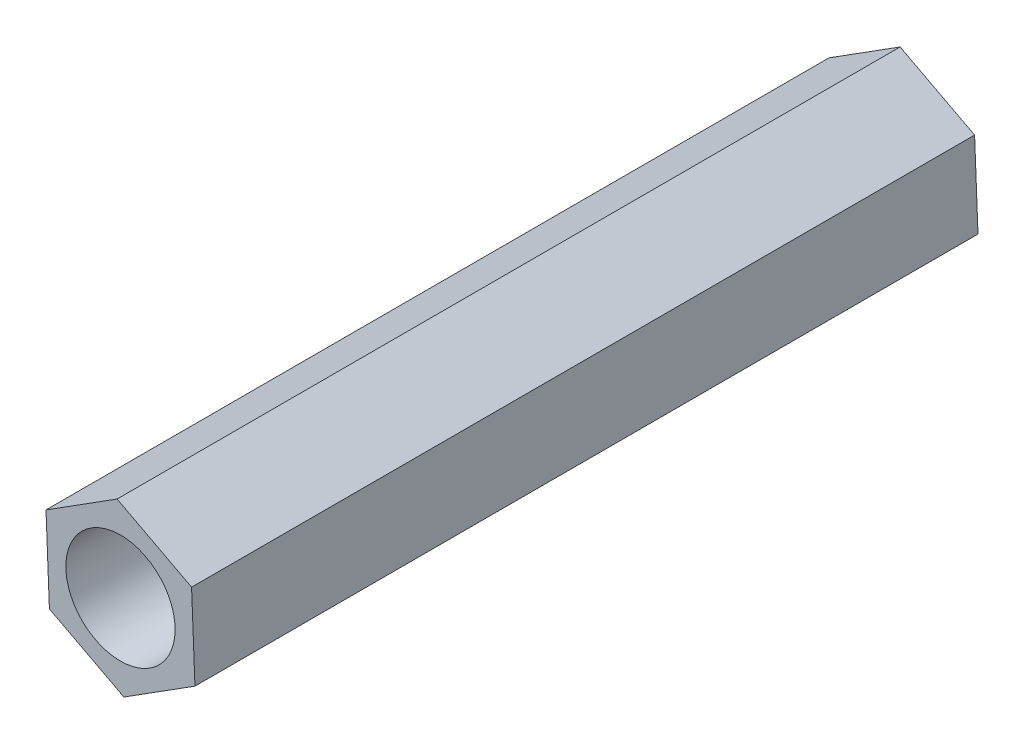
ISO-10303-21;
HEADER;
FILE_DESCRIPTION(('STEP AP214'),'2;1');
FILE_NAME('part.step','',(''),(''),'','','');
FILE_SCHEMA(('AUTOMOTIVE_DESIGN { 1 0 10303 214 1 1 1 1 }'));
ENDSEC;
DATA;
#1=APPLICATION_CONTEXT('core data for automotive mechanical design processes');
#2=APPLICATION_PROTOCOL_DEFINITION('international standard','automotive_design',2000,#1);
#3=PRODUCT_CONTEXT('',#1,'mechanical');
#4=PRODUCT('Part','Part','',(#3));
#5=PRODUCT_RELATED_PRODUCT_CATEGORY('part','',(#4));
#6=PRODUCT_DEFINITION_FORMATION('','',#4);
#7=PRODUCT_DEFINITION_CONTEXT('part definition',#1,'design');
#8=PRODUCT_DEFINITION('design','',#6,#7);
#9=PRODUCT_DEFINITION_SHAPE('','',#8);
#10=(LENGTH_UNIT() NAMED_UNIT(*) SI_UNIT(.MILLI.,.METRE.));
#11=(NAMED_UNIT(*) PLANE_ANGLE_UNIT() SI_UNIT($,.RADIAN.));
#12=(NAMED_UNIT(*) SI_UNIT($,.STERADIAN.) SOLID_ANGLE_UNIT());
#13=UNCERTAINTY_MEASURE_WITH_UNIT(LENGTH_MEASURE(1.E-05),#10,'distance_accuracy_value','');
#14=(GEOMETRIC_REPRESENTATION_CONTEXT(3) GLOBAL_UNCERTAINTY_ASSIGNED_CONTEXT((#13)) GLOBAL_UNIT_ASSIGNED_CONTEXT((#10,
#11,#12)) REPRESENTATION_CONTEXT('',''));
#15=CARTESIAN_POINT('',(0.,0.,0.));
#16=DIRECTION('',(0.,0.,1.));
#17=DIRECTION('',(1.,0.,0.));
#18=AXIS2_PLACEMENT_3D('',#15,#16,#17);
#19=CARTESIAN_POINT('',(0.187134398577114,-4.61500964789918,43.));
#20=DIRECTION('',(-0.53467714895708,0.845056416094883,0.));
#21=DIRECTION('',(-0.845056416094883,-0.53467714895708,0.));
#22=AXIS2_PLACEMENT_3D('',#19,#20,#21);
#23=PLANE('',#22);
#24=DIRECTION('',(0.845056416094883,0.53467714895708,0.));
#25=VECTOR('',#24,1.);
#26=CARTESIAN_POINT('',(0.187134398577114,-4.61500964789918,0.));
#27=LINE('',#26,#25);
#28=CARTESIAN_POINT('',(0.187134398577114,-4.61500964789918,0.));
#29=VERTEX_POINT('',#28);
#30=CARTESIAN_POINT('',(4.09028279307953,-2.14544168085989,0.));
#31=VERTEX_POINT('',#30);
#32=EDGE_CURVE('E131',#29,#31,#27,.T.);
#33=ORIENTED_EDGE('',*,*,#32,.T.);
#34=DIRECTION('',(0.,0.,-1.));
#35=VECTOR('',#34,1.);
#36=CARTESIAN_POINT('',(4.09028279307953,-2.14544168085989,43.));
#37=LINE('',#36,#35);
#38=CARTESIAN_POINT('',(4.09028279307953,-2.14544168085989,43.));
#39=VERTEX_POINT('',#38);
#40=EDGE_CURVE('E11',#39,#31,#37,.T.);
#41=ORIENTED_EDGE('',*,*,#40,.F.);
#42=DIRECTION('',(0.845056416094883,0.53467714895708,0.));
#43=VECTOR('',#42,1.);
#44=CARTESIAN_POINT('',(0.187134398577114,-4.61500964789918,43.));
#45=LINE('',#44,#43);
#46=CARTESIAN_POINT('',(0.187134398577114,-4.61500964789918,43.));
#47=VERTEX_POINT('',#46);
#48=EDGE_CURVE('E141',#47,#39,#45,.T.);
#49=ORIENTED_EDGE('',*,*,#48,.F.);
#50=DIRECTION('',(0.,0.,-1.));
#51=VECTOR('',#50,1.);
#52=CARTESIAN_POINT('',(0.187134398577114,-4.61500964789918,43.));
#53=LINE('',#52,#51);
#54=EDGE_CURVE('E118',#47,#29,#53,.T.);
#55=ORIENTED_EDGE('',*,*,#54,.T.);
#56=EDGE_LOOP('',(#33,#41,#49,#55));
#57=FACE_BOUND('',#56,.T.);
#58=ADVANCED_FACE('F37',(#57),#23,.F.);
#59=CARTESIAN_POINT('',(4.09028279307953,-2.14544168085989,43.));
#60=DIRECTION('',(-0.999178898447742,-0.0405157857724263,0.));
#61=DIRECTION('',(0.0405157857724263,-0.999178898447742,0.));
#62=AXIS2_PLACEMENT_3D('',#59,#60,#61);
#63=PLANE('',#62);
#64=DIRECTION('',(-0.0405157857724263,0.999178898447742,0.));
#65=VECTOR('',#64,1.);
#66=CARTESIAN_POINT('',(4.09028279307953,-2.14544168085989,0.));
#67=LINE('',#66,#65);
#68=CARTESIAN_POINT('',(3.90314839450241,2.4695679670393,0.));
#69=VERTEX_POINT('',#68);
#70=EDGE_CURVE('E127',#31,#69,#67,.T.);
#71=ORIENTED_EDGE('',*,*,#70,.T.);
#72=DIRECTION('',(0.,0.,-1.));
#73=VECTOR('',#72,1.);
#74=CARTESIAN_POINT('',(3.90314839450241,2.4695679670393,43.));
#75=LINE('',#74,#73);
#76=CARTESIAN_POINT('',(3.90314839450241,2.4695679670393,43.));
#77=VERTEX_POINT('',#76);
#78=EDGE_CURVE('E45',#77,#69,#75,.T.);
#79=ORIENTED_EDGE('',*,*,#78,.F.);
#80=DIRECTION('',(-0.0405157857724263,0.999178898447742,0.));
#81=VECTOR('',#80,1.);
#82=CARTESIAN_POINT('',(4.09028279307953,-2.14544168085989,43.));
#83=LINE('',#82,#81);
#84=EDGE_CURVE('E86',#39,#77,#83,.T.);
#85=ORIENTED_EDGE('',*,*,#84,.F.);
#86=ORIENTED_EDGE('',*,*,#40,.T.);
#87=EDGE_LOOP('',(#71,#79,#85,#86));
#88=FACE_BOUND('',#87,.T.);
#89=ADVANCED_FACE('F128',(#88),#63,.F.);
#90=CARTESIAN_POINT('',(3.90314839450241,2.4695679670393,43.));
#91=DIRECTION('',(-0.464501749490663,-0.885572201867309,0.));
#92=DIRECTION('',(0.885572201867309,-0.464501749490663,0.));
#93=AXIS2_PLACEMENT_3D('',#90,#91,#92);
#94=PLANE('',#93);
#95=DIRECTION('',(-0.885572201867309,0.464501749490663,0.));
#96=VECTOR('',#95,1.);
#97=CARTESIAN_POINT('',(3.90314839450241,2.4695679670393,0.));
#98=LINE('',#97,#96);
#99=CARTESIAN_POINT('',(-0.187134398577112,4.61500964789918,0.));
#100=VERTEX_POINT('',#99);
#101=EDGE_CURVE('E126',#69,#100,#98,.T.);
#102=ORIENTED_EDGE('',*,*,#101,.T.);
#103=DIRECTION('',(0.,0.,-1.));
#104=VECTOR('',#103,1.);
#105=CARTESIAN_POINT('',(-0.187134398577112,4.61500964789918,43.));
#106=LINE('',#105,#104);
#107=CARTESIAN_POINT('',(-0.187134398577112,4.61500964789918,43.));
#108=VERTEX_POINT('',#107);
#109=EDGE_CURVE('E115',#108,#100,#106,.T.);
#110=ORIENTED_EDGE('',*,*,#109,.F.);
#111=DIRECTION('',(-0.885572201867309,0.464501749490663,0.));
#112=VECTOR('',#111,1.);
#113=CARTESIAN_POINT('',(3.90314839450241,2.4695679670393,43.));
#114=LINE('',#113,#112);
#115=EDGE_CURVE('E108',#77,#108,#114,.T.);
#116=ORIENTED_EDGE('',*,*,#115,.F.);
#117=ORIENTED_EDGE('',*,*,#78,.T.);
#118=EDGE_LOOP('',(#102,#110,#116,#117));
#119=FACE_BOUND('',#118,.T.);
#120=ADVANCED_FACE('F125',(#119),#94,.F.);
#121=CARTESIAN_POINT('',(-0.187134398577112,4.61500964789918,43.));
#122=DIRECTION('',(0.53467714895708,-0.845056416094883,0.));
#123=DIRECTION('',(0.845056416094883,0.53467714895708,0.));
#124=AXIS2_PLACEMENT_3D('',#121,#122,#123);
#125=PLANE('',#124);
#126=DIRECTION('',(-0.845056416094883,-0.53467714895708,0.));
#127=VECTOR('',#126,1.);
#128=CARTESIAN_POINT('',(-0.187134398577112,4.61500964789918,0.));
#129=LINE('',#128,#127);
#130=CARTESIAN_POINT('',(-4.09028279307953,2.14544168085989,0.));
#131=VERTEX_POINT('',#130);
#132=EDGE_CURVE('E114',#100,#131,#129,.T.);
#133=ORIENTED_EDGE('',*,*,#132,.T.);
#134=DIRECTION('',(0.,0.,-1.));
#135=VECTOR('',#134,1.);
#136=CARTESIAN_POINT('',(-4.09028279307953,2.14544168085989,43.));
#137=LINE('',#136,#135);
#138=CARTESIAN_POINT('',(-4.09028279307953,2.14544168085989,43.));
#139=VERTEX_POINT('',#138);
#140=EDGE_CURVE('E101',#139,#131,#137,.T.);
#141=ORIENTED_EDGE('',*,*,#140,.F.);
#142=DIRECTION('',(-0.845056416094883,-0.53467714895708,0.));
#143=VECTOR('',#142,1.);
#144=CARTESIAN_POINT('',(-0.187134398577112,4.61500964789918,43.));
#145=LINE('',#144,#143);
#146=EDGE_CURVE('E104',#108,#139,#145,.T.);
#147=ORIENTED_EDGE('',*,*,#146,.F.);
#148=ORIENTED_EDGE('',*,*,#109,.T.);
#149=EDGE_LOOP('',(#133,#141,#147,#148));
#150=FACE_BOUND('',#149,.T.);
#151=ADVANCED_FACE('F113',(#150),#125,.F.);
#152=CARTESIAN_POINT('',(-4.09028279307953,2.14544168085989,43.));
#153=DIRECTION('',(0.999178898447742,0.0405157857724258,0.));
#154=DIRECTION('',(-0.0405157857724258,0.999178898447742,0.));
#155=AXIS2_PLACEMENT_3D('',#152,#153,#154);
#156=PLANE('',#155);
#157=DIRECTION('',(0.0405157857724258,-0.999178898447742,0.));
#158=VECTOR('',#157,1.);
#159=CARTESIAN_POINT('',(-4.09028279307953,2.14544168085989,0.));
#160=LINE('',#159,#158);
#161=CARTESIAN_POINT('',(-3.90314839450241,-2.46956796703929,0.));
#162=VERTEX_POINT('',#161);
#163=EDGE_CURVE('E139',#131,#162,#160,.T.);
#164=ORIENTED_EDGE('',*,*,#163,.T.);
#165=DIRECTION('',(0.,0.,-1.));
#166=VECTOR('',#165,1.);
#167=CARTESIAN_POINT('',(-3.90314839450241,-2.46956796703929,43.));
#168=LINE('',#167,#166);
#169=CARTESIAN_POINT('',(-3.90314839450241,-2.46956796703929,43.));
#170=VERTEX_POINT('',#169);
#171=EDGE_CURVE('E103',#170,#162,#168,.T.);
#172=ORIENTED_EDGE('',*,*,#171,.F.);
#173=DIRECTION('',(0.0405157857724258,-0.999178898447742,0.));
#174=VECTOR('',#173,1.);
#175=CARTESIAN_POINT('',(-4.09028279307953,2.14544168085989,43.));
#176=LINE('',#175,#174);
#177=EDGE_CURVE('E96',#139,#170,#176,.T.);
#178=ORIENTED_EDGE('',*,*,#177,.F.);
#179=ORIENTED_EDGE('',*,*,#140,.T.);
#180=EDGE_LOOP('',(#164,#172,#178,#179));
#181=FACE_BOUND('',#180,.T.);
#182=ADVANCED_FACE('F99',(#181),#156,.F.);
#183=CARTESIAN_POINT('',(-3.90314839450241,-2.46956796703929,43.));
#184=DIRECTION('',(0.464501749490662,0.885572201867309,0.));
#185=DIRECTION('',(-0.885572201867309,0.464501749490662,0.));
#186=AXIS2_PLACEMENT_3D('',#183,#184,#185);
#187=PLANE('',#186);
#188=DIRECTION('',(0.885572201867309,-0.464501749490662,0.));
#189=VECTOR('',#188,1.);
#190=CARTESIAN_POINT('',(-3.90314839450241,-2.46956796703929,0.));
#191=LINE('',#190,#189);
#192=EDGE_CURVE('E75',#162,#29,#191,.T.);
#193=ORIENTED_EDGE('',*,*,#192,.T.);
#194=ORIENTED_EDGE('',*,*,#54,.F.);
#195=DIRECTION('',(0.885572201867309,-0.464501749490662,0.));
#196=VECTOR('',#195,1.);
#197=CARTESIAN_POINT('',(-3.90314839450241,-2.46956796703929,43.));
#198=LINE('',#197,#196);
#199=EDGE_CURVE('E53',#170,#47,#198,.T.);
#200=ORIENTED_EDGE('',*,*,#199,.F.);
#201=ORIENTED_EDGE('',*,*,#171,.T.);
#202=EDGE_LOOP('',(#193,#194,#200,#201));
#203=FACE_BOUND('',#202,.T.);
#204=ADVANCED_FACE('F159',(#203),#187,.F.);
#205=CARTESIAN_POINT('',(0.,0.,43.));
#206=DIRECTION('',(0.,0.,1.));
#207=DIRECTION('',(1.,0.,0.));
#208=AXIS2_PLACEMENT_3D('',#205,#206,#207);
#209=PLANE('',#208);
#210=CARTESIAN_POINT('',(0.,0.,43.));
#211=DIRECTION('',(0.,0.,1.));
#212=DIRECTION('',(1.,0.,0.));
#213=AXIS2_PLACEMENT_3D('',#210,#211,#212);
#214=CIRCLE('',#213,3.);
#215=CARTESIAN_POINT('',(3.,0.,43.));
#216=VERTEX_POINT('',#215);
#217=EDGE_CURVE('E150',#216,#216,#214,.T.);
#218=ORIENTED_EDGE('',*,*,#217,.F.);
#219=EDGE_LOOP('',(#218));
#220=FACE_BOUND('',#219,.T.);
#221=ORIENTED_EDGE('',*,*,#48,.T.);
#222=ORIENTED_EDGE('',*,*,#84,.T.);
#223=ORIENTED_EDGE('',*,*,#115,.T.);
#224=ORIENTED_EDGE('',*,*,#146,.T.);
#225=ORIENTED_EDGE('',*,*,#177,.T.);
#226=ORIENTED_EDGE('',*,*,#199,.T.);
#227=EDGE_LOOP('',(#221,#222,#223,#224,#225,#226));
#228=FACE_BOUND('',#227,.T.);
#229=ADVANCED_FACE('F107',(#220,#228),#209,.T.);
#230=CARTESIAN_POINT('',(0.,0.,0.));
#231=DIRECTION('',(0.,0.,1.));
#232=DIRECTION('',(1.,0.,0.));
#233=AXIS2_PLACEMENT_3D('',#230,#231,#232);
#234=PLANE('',#233);
#235=CARTESIAN_POINT('',(0.,0.,0.));
#236=DIRECTION('',(0.,0.,1.));
#237=DIRECTION('',(1.,0.,0.));
#238=AXIS2_PLACEMENT_3D('',#235,#236,#237);
#239=CIRCLE('',#238,3.);
#240=CARTESIAN_POINT('',(3.,0.,0.));
#241=VERTEX_POINT('',#240);
#242=EDGE_CURVE('E134',#241,#241,#239,.F.);
#243=ORIENTED_EDGE('',*,*,#242,.F.);
#244=EDGE_LOOP('',(#243));
#245=FACE_BOUND('',#244,.T.);
#246=ORIENTED_EDGE('',*,*,#32,.F.);
#247=ORIENTED_EDGE('',*,*,#192,.F.);
#248=ORIENTED_EDGE('',*,*,#163,.F.);
#249=ORIENTED_EDGE('',*,*,#132,.F.);
#250=ORIENTED_EDGE('',*,*,#101,.F.);
#251=ORIENTED_EDGE('',*,*,#70,.F.);
#252=EDGE_LOOP('',(#246,#247,#248,#249,#250,#251));
#253=FACE_BOUND('',#252,.T.);
#254=ADVANCED_FACE('F158',(#245,#253),#234,.F.);
#255=CARTESIAN_POINT('',(0.,0.,-0.001000000000001));
#256=DIRECTION('',(0.,0.,1.));
#257=DIRECTION('',(1.,0.,0.));
#258=AXIS2_PLACEMENT_3D('',#255,#256,#257);
#259=CYLINDRICAL_SURFACE('',#258,3.);
#260=ORIENTED_EDGE('',*,*,#217,.T.);
#261=EDGE_LOOP('',(#260));
#262=FACE_BOUND('',#261,.T.);
#263=ORIENTED_EDGE('',*,*,#242,.T.);
#264=EDGE_LOOP('',(#263));
#265=FACE_BOUND('',#264,.T.);
#266=ADVANCED_FACE('F154',(#262,#265),#259,.F.);
#267=CLOSED_SHELL('',(#58,#89,#120,#151,#182,#204,#229,#254,#266));
#268=MANIFOLD_SOLID_BREP('B2',#267);
#269=ADVANCED_BREP_SHAPE_REPRESENTATION('',(#18,#268),#14);
#270=SHAPE_DEFINITION_REPRESENTATION(#9,#269);
ENDSEC;
END-ISO-10303-21;
